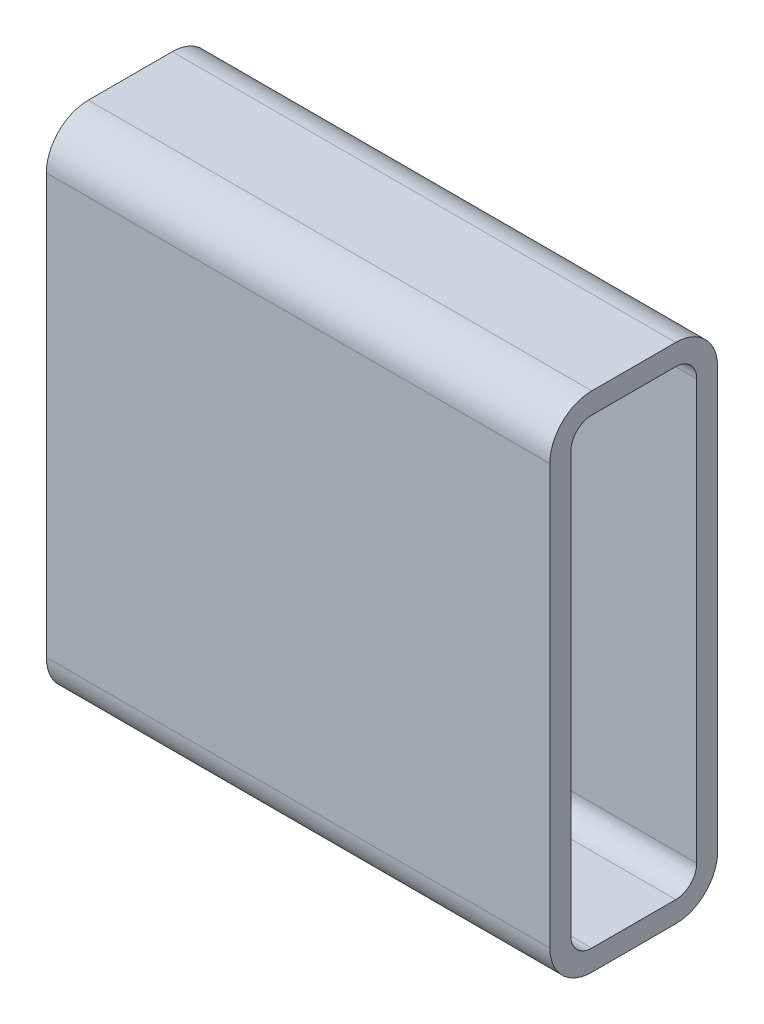
ISO-10303-21;
HEADER;
FILE_DESCRIPTION(('STEP AP214'),'2;1');
FILE_NAME('part.step','',(''),(''),'','','');
FILE_SCHEMA(('AUTOMOTIVE_DESIGN { 1 0 10303 214 1 1 1 1 }'));
ENDSEC;
DATA;
#1=APPLICATION_CONTEXT('core data for automotive mechanical design processes');
#2=APPLICATION_PROTOCOL_DEFINITION('international standard','automotive_design',2000,#1);
#3=PRODUCT_CONTEXT('',#1,'mechanical');
#4=PRODUCT('Part','Part','',(#3));
#5=PRODUCT_RELATED_PRODUCT_CATEGORY('part','',(#4));
#6=PRODUCT_DEFINITION_FORMATION('','',#4);
#7=PRODUCT_DEFINITION_CONTEXT('part definition',#1,'design');
#8=PRODUCT_DEFINITION('design','',#6,#7);
#9=PRODUCT_DEFINITION_SHAPE('','',#8);
#10=(LENGTH_UNIT() NAMED_UNIT(*) SI_UNIT(.MILLI.,.METRE.));
#11=(NAMED_UNIT(*) PLANE_ANGLE_UNIT() SI_UNIT($,.RADIAN.));
#12=(NAMED_UNIT(*) SI_UNIT($,.STERADIAN.) SOLID_ANGLE_UNIT());
#13=UNCERTAINTY_MEASURE_WITH_UNIT(LENGTH_MEASURE(1.E-05),#10,'distance_accuracy_value','');
#14=(GEOMETRIC_REPRESENTATION_CONTEXT(3) GLOBAL_UNCERTAINTY_ASSIGNED_CONTEXT((#13)) GLOBAL_UNIT_ASSIGNED_CONTEXT((#10,
#11,#12)) REPRESENTATION_CONTEXT('',''));
#15=CARTESIAN_POINT('',(0.,0.,0.));
#16=DIRECTION('',(0.,0.,1.));
#17=DIRECTION('',(1.,0.,0.));
#18=AXIS2_PLACEMENT_3D('',#15,#16,#17);
#19=CARTESIAN_POINT('',(0.,-38.1,-6.35));
#20=DIRECTION('',(0.,-1.,0.));
#21=DIRECTION('',(0.,0.,-1.));
#22=AXIS2_PLACEMENT_3D('',#19,#20,#21);
#23=PLANE('',#22);
#24=DIRECTION('',(1.,0.,0.));
#25=VECTOR('',#24,1.);
#26=CARTESIAN_POINT('',(0.,-38.1,-6.35));
#27=LINE('',#26,#25);
#28=CARTESIAN_POINT('',(0.,-38.1,-6.35));
#29=VERTEX_POINT('',#28);
#30=CARTESIAN_POINT('',(76.2,-38.1,-6.35));
#31=VERTEX_POINT('',#30);
#32=EDGE_CURVE('E111',#29,#31,#27,.T.);
#33=ORIENTED_EDGE('',*,*,#32,.F.);
#34=DIRECTION('',(0.,0.,-1.));
#35=VECTOR('',#34,1.);
#36=CARTESIAN_POINT('',(0.,-38.1,0.));
#37=LINE('',#36,#35);
#38=CARTESIAN_POINT('',(0.,-38.1,-19.05));
#39=VERTEX_POINT('',#38);
#40=EDGE_CURVE('E213',#29,#39,#37,.T.);
#41=ORIENTED_EDGE('',*,*,#40,.T.);
#42=DIRECTION('',(1.,0.,0.));
#43=VECTOR('',#42,1.);
#44=CARTESIAN_POINT('',(0.,-38.1,-19.05));
#45=LINE('',#44,#43);
#46=CARTESIAN_POINT('',(76.2,-38.1,-19.05));
#47=VERTEX_POINT('',#46);
#48=EDGE_CURVE('E188',#47,#39,#45,.F.);
#49=ORIENTED_EDGE('',*,*,#48,.F.);
#50=DIRECTION('',(0.,0.,-1.));
#51=VECTOR('',#50,1.);
#52=CARTESIAN_POINT('',(76.2,-38.1,0.));
#53=LINE('',#52,#51);
#54=EDGE_CURVE('E115',#31,#47,#53,.T.);
#55=ORIENTED_EDGE('',*,*,#54,.F.);
#56=EDGE_LOOP('',(#33,#41,#49,#55));
#57=FACE_BOUND('',#56,.T.);
#58=ADVANCED_FACE('F17',(#57),#23,.T.);
#59=CARTESIAN_POINT('',(0.,-31.75,-19.05));
#60=DIRECTION('',(1.,0.,0.));
#61=DIRECTION('',(0.,0.,-1.));
#62=AXIS2_PLACEMENT_3D('',#59,#60,#61);
#63=CYLINDRICAL_SURFACE('',#62,6.35);
#64=ORIENTED_EDGE('',*,*,#48,.T.);
#65=CARTESIAN_POINT('',(0.,-31.75,-19.05));
#66=DIRECTION('',(1.,0.,0.));
#67=DIRECTION('',(0.,0.,-1.));
#68=AXIS2_PLACEMENT_3D('',#65,#66,#67);
#69=CIRCLE('',#68,6.35);
#70=CARTESIAN_POINT('',(0.,-31.75,-25.4));
#71=VERTEX_POINT('',#70);
#72=EDGE_CURVE('E211',#39,#71,#69,.T.);
#73=ORIENTED_EDGE('',*,*,#72,.T.);
#74=DIRECTION('',(-1.,0.,0.));
#75=VECTOR('',#74,1.);
#76=CARTESIAN_POINT('',(0.,-31.75,-25.4));
#77=LINE('',#76,#75);
#78=CARTESIAN_POINT('',(76.2,-31.75,-25.4));
#79=VERTEX_POINT('',#78);
#80=EDGE_CURVE('E185',#79,#71,#77,.T.);
#81=ORIENTED_EDGE('',*,*,#80,.F.);
#82=CARTESIAN_POINT('',(76.2,-31.75,-19.05));
#83=DIRECTION('',(1.,0.,0.));
#84=DIRECTION('',(0.,0.,-1.));
#85=AXIS2_PLACEMENT_3D('',#82,#83,#84);
#86=CIRCLE('',#85,6.35);
#87=EDGE_CURVE('E154',#47,#79,#86,.T.);
#88=ORIENTED_EDGE('',*,*,#87,.F.);
#89=EDGE_LOOP('',(#64,#73,#81,#88));
#90=FACE_BOUND('',#89,.T.);
#91=ADVANCED_FACE('F229',(#90),#63,.T.);
#92=CARTESIAN_POINT('',(0.,-31.75,-25.4));
#93=DIRECTION('',(0.,0.,-1.));
#94=DIRECTION('',(-1.,0.,0.));
#95=AXIS2_PLACEMENT_3D('',#92,#93,#94);
#96=PLANE('',#95);
#97=ORIENTED_EDGE('',*,*,#80,.T.);
#98=DIRECTION('',(0.,1.,0.));
#99=VECTOR('',#98,1.);
#100=CARTESIAN_POINT('',(0.,0.,-25.4));
#101=LINE('',#100,#99);
#102=CARTESIAN_POINT('',(0.,31.75,-25.4));
#103=VERTEX_POINT('',#102);
#104=EDGE_CURVE('E210',#71,#103,#101,.T.);
#105=ORIENTED_EDGE('',*,*,#104,.T.);
#106=DIRECTION('',(1.,0.,0.));
#107=VECTOR('',#106,1.);
#108=CARTESIAN_POINT('',(0.,31.75,-25.4));
#109=LINE('',#108,#107);
#110=CARTESIAN_POINT('',(76.2,31.75,-25.4));
#111=VERTEX_POINT('',#110);
#112=EDGE_CURVE('E182',#111,#103,#109,.F.);
#113=ORIENTED_EDGE('',*,*,#112,.F.);
#114=DIRECTION('',(0.,1.,0.));
#115=VECTOR('',#114,1.);
#116=CARTESIAN_POINT('',(76.2,0.,-25.4));
#117=LINE('',#116,#115);
#118=EDGE_CURVE('E151',#79,#111,#117,.T.);
#119=ORIENTED_EDGE('',*,*,#118,.F.);
#120=EDGE_LOOP('',(#97,#105,#113,#119));
#121=FACE_BOUND('',#120,.T.);
#122=ADVANCED_FACE('F233',(#121),#96,.T.);
#123=CARTESIAN_POINT('',(0.,31.75,-19.05));
#124=DIRECTION('',(1.,0.,0.));
#125=DIRECTION('',(0.,0.,-1.));
#126=AXIS2_PLACEMENT_3D('',#123,#124,#125);
#127=CYLINDRICAL_SURFACE('',#126,6.35);
#128=ORIENTED_EDGE('',*,*,#112,.T.);
#129=CARTESIAN_POINT('',(0.,31.75,-19.05));
#130=DIRECTION('',(1.,0.,0.));
#131=DIRECTION('',(0.,0.,-1.));
#132=AXIS2_PLACEMENT_3D('',#129,#130,#131);
#133=CIRCLE('',#132,6.35);
#134=CARTESIAN_POINT('',(0.,38.1,-19.05));
#135=VERTEX_POINT('',#134);
#136=EDGE_CURVE('E208',#103,#135,#133,.T.);
#137=ORIENTED_EDGE('',*,*,#136,.T.);
#138=DIRECTION('',(1.,0.,0.));
#139=VECTOR('',#138,1.);
#140=CARTESIAN_POINT('',(0.,38.1,-19.05));
#141=LINE('',#140,#139);
#142=CARTESIAN_POINT('',(76.2,38.1,-19.05));
#143=VERTEX_POINT('',#142);
#144=EDGE_CURVE('E176',#143,#135,#141,.F.);
#145=ORIENTED_EDGE('',*,*,#144,.F.);
#146=CARTESIAN_POINT('',(76.2,31.75,-19.05));
#147=DIRECTION('',(1.,0.,0.));
#148=DIRECTION('',(0.,0.,-1.));
#149=AXIS2_PLACEMENT_3D('',#146,#147,#148);
#150=CIRCLE('',#149,6.35);
#151=EDGE_CURVE('E150',#111,#143,#150,.T.);
#152=ORIENTED_EDGE('',*,*,#151,.F.);
#153=EDGE_LOOP('',(#128,#137,#145,#152));
#154=FACE_BOUND('',#153,.T.);
#155=ADVANCED_FACE('F237',(#154),#127,.T.);
#156=CARTESIAN_POINT('',(0.,38.1,-19.05));
#157=DIRECTION('',(0.,1.,0.));
#158=DIRECTION('',(0.,0.,1.));
#159=AXIS2_PLACEMENT_3D('',#156,#157,#158);
#160=PLANE('',#159);
#161=ORIENTED_EDGE('',*,*,#144,.T.);
#162=DIRECTION('',(0.,0.,-1.));
#163=VECTOR('',#162,1.);
#164=CARTESIAN_POINT('',(0.,38.1,0.));
#165=LINE('',#164,#163);
#166=CARTESIAN_POINT('',(0.,38.1,-6.35));
#167=VERTEX_POINT('',#166);
#168=EDGE_CURVE('E207',#135,#167,#165,.F.);
#169=ORIENTED_EDGE('',*,*,#168,.T.);
#170=DIRECTION('',(1.,0.,0.));
#171=VECTOR('',#170,1.);
#172=CARTESIAN_POINT('',(0.,38.1,-6.35));
#173=LINE('',#172,#171);
#174=CARTESIAN_POINT('',(76.2,38.1,-6.35));
#175=VERTEX_POINT('',#174);
#176=EDGE_CURVE('E177',#175,#167,#173,.F.);
#177=ORIENTED_EDGE('',*,*,#176,.F.);
#178=DIRECTION('',(0.,0.,-1.));
#179=VECTOR('',#178,1.);
#180=CARTESIAN_POINT('',(76.2,38.1,0.));
#181=LINE('',#180,#179);
#182=EDGE_CURVE('E148',#143,#175,#181,.F.);
#183=ORIENTED_EDGE('',*,*,#182,.F.);
#184=EDGE_LOOP('',(#161,#169,#177,#183));
#185=FACE_BOUND('',#184,.T.);
#186=ADVANCED_FACE('F242',(#185),#160,.T.);
#187=CARTESIAN_POINT('',(0.,-31.75,-19.05));
#188=DIRECTION('',(1.,0.,0.));
#189=DIRECTION('',(0.,0.,-1.));
#190=AXIS2_PLACEMENT_3D('',#187,#188,#189);
#191=CYLINDRICAL_SURFACE('',#190,3.175);
#192=CARTESIAN_POINT('',(76.2,-31.75,-19.05));
#193=DIRECTION('',(1.,0.,0.));
#194=DIRECTION('',(0.,0.,-1.));
#195=AXIS2_PLACEMENT_3D('',#192,#193,#194);
#196=CIRCLE('',#195,3.175);
#197=CARTESIAN_POINT('',(76.2,-31.75,-22.225));
#198=VERTEX_POINT('',#197);
#199=CARTESIAN_POINT('',(76.2,-34.925,-19.05));
#200=VERTEX_POINT('',#199);
#201=EDGE_CURVE('E135',#198,#200,#196,.F.);
#202=ORIENTED_EDGE('',*,*,#201,.F.);
#203=DIRECTION('',(1.,0.,0.));
#204=VECTOR('',#203,1.);
#205=CARTESIAN_POINT('',(0.,-31.75,-22.225));
#206=LINE('',#205,#204);
#207=CARTESIAN_POINT('',(0.,-31.75,-22.225));
#208=VERTEX_POINT('',#207);
#209=EDGE_CURVE('E159',#208,#198,#206,.T.);
#210=ORIENTED_EDGE('',*,*,#209,.F.);
#211=CARTESIAN_POINT('',(0.,-31.75,-19.05));
#212=DIRECTION('',(1.,0.,0.));
#213=DIRECTION('',(0.,0.,-1.));
#214=AXIS2_PLACEMENT_3D('',#211,#212,#213);
#215=CIRCLE('',#214,3.175);
#216=CARTESIAN_POINT('',(0.,-34.925,-19.05));
#217=VERTEX_POINT('',#216);
#218=EDGE_CURVE('E203',#208,#217,#215,.F.);
#219=ORIENTED_EDGE('',*,*,#218,.T.);
#220=DIRECTION('',(1.,0.,0.));
#221=VECTOR('',#220,1.);
#222=CARTESIAN_POINT('',(0.,-34.925,-19.05));
#223=LINE('',#222,#221);
#224=EDGE_CURVE('E173',#200,#217,#223,.F.);
#225=ORIENTED_EDGE('',*,*,#224,.F.);
#226=EDGE_LOOP('',(#202,#210,#219,#225));
#227=FACE_BOUND('',#226,.T.);
#228=ADVANCED_FACE('F307',(#227),#191,.F.);
#229=CARTESIAN_POINT('',(0.,-34.925,-19.05));
#230=DIRECTION('',(0.,1.,0.));
#231=DIRECTION('',(0.,0.,1.));
#232=AXIS2_PLACEMENT_3D('',#229,#230,#231);
#233=PLANE('',#232);
#234=ORIENTED_EDGE('',*,*,#224,.T.);
#235=DIRECTION('',(0.,0.,-1.));
#236=VECTOR('',#235,1.);
#237=CARTESIAN_POINT('',(0.,-34.925,0.));
#238=LINE('',#237,#236);
#239=CARTESIAN_POINT('',(0.,-34.925,-6.35));
#240=VERTEX_POINT('',#239);
#241=EDGE_CURVE('E202',#217,#240,#238,.F.);
#242=ORIENTED_EDGE('',*,*,#241,.T.);
#243=DIRECTION('',(1.,0.,0.));
#244=VECTOR('',#243,1.);
#245=CARTESIAN_POINT('',(0.,-34.925,-6.35));
#246=LINE('',#245,#244);
#247=CARTESIAN_POINT('',(76.2,-34.925,-6.35));
#248=VERTEX_POINT('',#247);
#249=EDGE_CURVE('E171',#240,#248,#246,.T.);
#250=ORIENTED_EDGE('',*,*,#249,.T.);
#251=DIRECTION('',(0.,0.,-1.));
#252=VECTOR('',#251,1.);
#253=CARTESIAN_POINT('',(76.2,-34.925,0.));
#254=LINE('',#253,#252);
#255=EDGE_CURVE('E145',#200,#248,#254,.F.);
#256=ORIENTED_EDGE('',*,*,#255,.F.);
#257=EDGE_LOOP('',(#234,#242,#250,#256));
#258=FACE_BOUND('',#257,.T.);
#259=ADVANCED_FACE('F306',(#258),#233,.T.);
#260=CARTESIAN_POINT('',(0.,-31.75,-6.35));
#261=DIRECTION('',(1.,0.,0.));
#262=DIRECTION('',(0.,0.,-1.));
#263=AXIS2_PLACEMENT_3D('',#260,#261,#262);
#264=CYLINDRICAL_SURFACE('',#263,3.175);
#265=CARTESIAN_POINT('',(76.2,-31.75,-6.35));
#266=DIRECTION('',(1.,0.,0.));
#267=DIRECTION('',(0.,0.,-1.));
#268=AXIS2_PLACEMENT_3D('',#265,#266,#267);
#269=CIRCLE('',#268,3.175);
#270=CARTESIAN_POINT('',(76.2,-31.75,-3.175));
#271=VERTEX_POINT('',#270);
#272=EDGE_CURVE('E144',#248,#271,#269,.F.);
#273=ORIENTED_EDGE('',*,*,#272,.F.);
#274=ORIENTED_EDGE('',*,*,#249,.F.);
#275=CARTESIAN_POINT('',(0.,-31.75,-6.35));
#276=DIRECTION('',(1.,0.,0.));
#277=DIRECTION('',(0.,0.,-1.));
#278=AXIS2_PLACEMENT_3D('',#275,#276,#277);
#279=CIRCLE('',#278,3.175);
#280=CARTESIAN_POINT('',(0.,-31.75,-3.175));
#281=VERTEX_POINT('',#280);
#282=EDGE_CURVE('E199',#240,#281,#279,.F.);
#283=ORIENTED_EDGE('',*,*,#282,.T.);
#284=DIRECTION('',(-1.,0.,0.));
#285=VECTOR('',#284,1.);
#286=CARTESIAN_POINT('',(0.,-31.75,-3.175));
#287=LINE('',#286,#285);
#288=EDGE_CURVE('E168',#271,#281,#287,.T.);
#289=ORIENTED_EDGE('',*,*,#288,.F.);
#290=EDGE_LOOP('',(#273,#274,#283,#289));
#291=FACE_BOUND('',#290,.T.);
#292=ADVANCED_FACE('F304',(#291),#264,.F.);
#293=CARTESIAN_POINT('',(0.,-31.75,-3.175));
#294=DIRECTION('',(0.,0.,-1.));
#295=DIRECTION('',(-1.,0.,0.));
#296=AXIS2_PLACEMENT_3D('',#293,#294,#295);
#297=PLANE('',#296);
#298=ORIENTED_EDGE('',*,*,#288,.T.);
#299=DIRECTION('',(0.,1.,0.));
#300=VECTOR('',#299,1.);
#301=CARTESIAN_POINT('',(0.,0.,-3.175));
#302=LINE('',#301,#300);
#303=CARTESIAN_POINT('',(0.,31.75,-3.175));
#304=VERTEX_POINT('',#303);
#305=EDGE_CURVE('E198',#281,#304,#302,.T.);
#306=ORIENTED_EDGE('',*,*,#305,.T.);
#307=DIRECTION('',(1.,0.,0.));
#308=VECTOR('',#307,1.);
#309=CARTESIAN_POINT('',(0.,31.75,-3.175));
#310=LINE('',#309,#308);
#311=CARTESIAN_POINT('',(76.2,31.75,-3.175));
#312=VERTEX_POINT('',#311);
#313=EDGE_CURVE('E166',#304,#312,#310,.T.);
#314=ORIENTED_EDGE('',*,*,#313,.T.);
#315=DIRECTION('',(0.,1.,0.));
#316=VECTOR('',#315,1.);
#317=CARTESIAN_POINT('',(76.2,0.,-3.175));
#318=LINE('',#317,#316);
#319=EDGE_CURVE('E141',#271,#312,#318,.T.);
#320=ORIENTED_EDGE('',*,*,#319,.F.);
#321=EDGE_LOOP('',(#298,#306,#314,#320));
#322=FACE_BOUND('',#321,.T.);
#323=ADVANCED_FACE('F293',(#322),#297,.T.);
#324=CARTESIAN_POINT('',(0.,31.75,-6.35));
#325=DIRECTION('',(1.,0.,0.));
#326=DIRECTION('',(0.,0.,-1.));
#327=AXIS2_PLACEMENT_3D('',#324,#325,#326);
#328=CYLINDRICAL_SURFACE('',#327,3.175);
#329=CARTESIAN_POINT('',(76.2,31.75,-6.35));
#330=DIRECTION('',(1.,0.,0.));
#331=DIRECTION('',(0.,0.,-1.));
#332=AXIS2_PLACEMENT_3D('',#329,#330,#331);
#333=CIRCLE('',#332,3.175);
#334=CARTESIAN_POINT('',(76.2,34.925,-6.35));
#335=VERTEX_POINT('',#334);
#336=EDGE_CURVE('E140',#312,#335,#333,.F.);
#337=ORIENTED_EDGE('',*,*,#336,.F.);
#338=ORIENTED_EDGE('',*,*,#313,.F.);
#339=CARTESIAN_POINT('',(0.,31.75,-6.35));
#340=DIRECTION('',(1.,0.,0.));
#341=DIRECTION('',(0.,0.,-1.));
#342=AXIS2_PLACEMENT_3D('',#339,#340,#341);
#343=CIRCLE('',#342,3.175);
#344=CARTESIAN_POINT('',(0.,34.925,-6.35));
#345=VERTEX_POINT('',#344);
#346=EDGE_CURVE('E195',#304,#345,#343,.F.);
#347=ORIENTED_EDGE('',*,*,#346,.T.);
#348=DIRECTION('',(1.,0.,0.));
#349=VECTOR('',#348,1.);
#350=CARTESIAN_POINT('',(0.,34.925,-6.35));
#351=LINE('',#350,#349);
#352=EDGE_CURVE('E163',#335,#345,#351,.F.);
#353=ORIENTED_EDGE('',*,*,#352,.F.);
#354=EDGE_LOOP('',(#337,#338,#347,#353));
#355=FACE_BOUND('',#354,.T.);
#356=ADVANCED_FACE('F298',(#355),#328,.F.);
#357=CARTESIAN_POINT('',(0.,34.925,-6.35));
#358=DIRECTION('',(0.,-1.,0.));
#359=DIRECTION('',(0.,0.,-1.));
#360=AXIS2_PLACEMENT_3D('',#357,#358,#359);
#361=PLANE('',#360);
#362=ORIENTED_EDGE('',*,*,#352,.T.);
#363=DIRECTION('',(0.,0.,-1.));
#364=VECTOR('',#363,1.);
#365=CARTESIAN_POINT('',(0.,34.925,0.));
#366=LINE('',#365,#364);
#367=CARTESIAN_POINT('',(0.,34.925,-19.05));
#368=VERTEX_POINT('',#367);
#369=EDGE_CURVE('E194',#345,#368,#366,.T.);
#370=ORIENTED_EDGE('',*,*,#369,.T.);
#371=DIRECTION('',(1.,0.,0.));
#372=VECTOR('',#371,1.);
#373=CARTESIAN_POINT('',(0.,34.925,-19.05));
#374=LINE('',#373,#372);
#375=CARTESIAN_POINT('',(76.2,34.925,-19.05));
#376=VERTEX_POINT('',#375);
#377=EDGE_CURVE('E161',#368,#376,#374,.T.);
#378=ORIENTED_EDGE('',*,*,#377,.T.);
#379=DIRECTION('',(0.,0.,-1.));
#380=VECTOR('',#379,1.);
#381=CARTESIAN_POINT('',(76.2,34.925,0.));
#382=LINE('',#381,#380);
#383=EDGE_CURVE('E137',#335,#376,#382,.T.);
#384=ORIENTED_EDGE('',*,*,#383,.F.);
#385=EDGE_LOOP('',(#362,#370,#378,#384));
#386=FACE_BOUND('',#385,.T.);
#387=ADVANCED_FACE('F258',(#386),#361,.T.);
#388=CARTESIAN_POINT('',(0.,31.75,-19.05));
#389=DIRECTION('',(1.,0.,0.));
#390=DIRECTION('',(0.,0.,-1.));
#391=AXIS2_PLACEMENT_3D('',#388,#389,#390);
#392=CYLINDRICAL_SURFACE('',#391,3.175);
#393=CARTESIAN_POINT('',(76.2,31.75,-19.05));
#394=DIRECTION('',(1.,0.,0.));
#395=DIRECTION('',(0.,0.,-1.));
#396=AXIS2_PLACEMENT_3D('',#393,#394,#395);
#397=CIRCLE('',#396,3.175);
#398=CARTESIAN_POINT('',(76.2,31.75,-22.225));
#399=VERTEX_POINT('',#398);
#400=EDGE_CURVE('E136',#376,#399,#397,.F.);
#401=ORIENTED_EDGE('',*,*,#400,.F.);
#402=ORIENTED_EDGE('',*,*,#377,.F.);
#403=CARTESIAN_POINT('',(0.,31.75,-19.05));
#404=DIRECTION('',(1.,0.,0.));
#405=DIRECTION('',(0.,0.,-1.));
#406=AXIS2_PLACEMENT_3D('',#403,#404,#405);
#407=CIRCLE('',#406,3.175);
#408=CARTESIAN_POINT('',(0.,31.75,-22.225));
#409=VERTEX_POINT('',#408);
#410=EDGE_CURVE('E128',#368,#409,#407,.F.);
#411=ORIENTED_EDGE('',*,*,#410,.T.);
#412=DIRECTION('',(1.,0.,0.));
#413=VECTOR('',#412,1.);
#414=CARTESIAN_POINT('',(0.,31.75,-22.225));
#415=LINE('',#414,#413);
#416=EDGE_CURVE('E156',#399,#409,#415,.F.);
#417=ORIENTED_EDGE('',*,*,#416,.F.);
#418=EDGE_LOOP('',(#401,#402,#411,#417));
#419=FACE_BOUND('',#418,.T.);
#420=ADVANCED_FACE('F267',(#419),#392,.F.);
#421=CARTESIAN_POINT('',(0.,31.75,-22.225));
#422=DIRECTION('',(0.,0.,1.));
#423=DIRECTION('',(1.,0.,0.));
#424=AXIS2_PLACEMENT_3D('',#421,#422,#423);
#425=PLANE('',#424);
#426=ORIENTED_EDGE('',*,*,#416,.T.);
#427=DIRECTION('',(0.,1.,0.));
#428=VECTOR('',#427,1.);
#429=CARTESIAN_POINT('',(0.,0.,-22.225));
#430=LINE('',#429,#428);
#431=EDGE_CURVE('E125',#409,#208,#430,.F.);
#432=ORIENTED_EDGE('',*,*,#431,.T.);
#433=ORIENTED_EDGE('',*,*,#209,.T.);
#434=DIRECTION('',(0.,1.,0.));
#435=VECTOR('',#434,1.);
#436=CARTESIAN_POINT('',(76.2,0.,-22.225));
#437=LINE('',#436,#435);
#438=EDGE_CURVE('E132',#399,#198,#437,.F.);
#439=ORIENTED_EDGE('',*,*,#438,.F.);
#440=EDGE_LOOP('',(#426,#432,#433,#439));
#441=FACE_BOUND('',#440,.T.);
#442=ADVANCED_FACE('F276',(#441),#425,.T.);
#443=CARTESIAN_POINT('',(0.,-31.75,-6.35));
#444=DIRECTION('',(1.,0.,0.));
#445=DIRECTION('',(0.,0.,-1.));
#446=AXIS2_PLACEMENT_3D('',#443,#444,#445);
#447=CYLINDRICAL_SURFACE('',#446,6.35);
#448=DIRECTION('',(1.,0.,0.));
#449=VECTOR('',#448,1.);
#450=CARTESIAN_POINT('',(0.,-31.75,0.));
#451=LINE('',#450,#449);
#452=CARTESIAN_POINT('',(0.,-31.75,0.));
#453=VERTEX_POINT('',#452);
#454=CARTESIAN_POINT('',(76.2,-31.75,0.));
#455=VERTEX_POINT('',#454);
#456=EDGE_CURVE('E109',#453,#455,#451,.T.);
#457=ORIENTED_EDGE('',*,*,#456,.F.);
#458=CARTESIAN_POINT('',(0.,-31.75,-6.35));
#459=DIRECTION('',(1.,0.,0.));
#460=DIRECTION('',(0.,0.,-1.));
#461=AXIS2_PLACEMENT_3D('',#458,#459,#460);
#462=CIRCLE('',#461,6.35);
#463=EDGE_CURVE('E179',#453,#29,#462,.T.);
#464=ORIENTED_EDGE('',*,*,#463,.T.);
#465=ORIENTED_EDGE('',*,*,#32,.T.);
#466=CARTESIAN_POINT('',(76.2,-31.75,-6.35));
#467=DIRECTION('',(1.,0.,0.));
#468=DIRECTION('',(0.,0.,-1.));
#469=AXIS2_PLACEMENT_3D('',#466,#467,#468);
#470=CIRCLE('',#469,6.35);
#471=EDGE_CURVE('E20',#455,#31,#470,.T.);
#472=ORIENTED_EDGE('',*,*,#471,.F.);
#473=EDGE_LOOP('',(#457,#464,#465,#472));
#474=FACE_BOUND('',#473,.T.);
#475=ADVANCED_FACE('F106',(#474),#447,.T.);
#476=CARTESIAN_POINT('',(76.2,0.,0.));
#477=DIRECTION('',(1.,0.,0.));
#478=DIRECTION('',(0.,0.,-1.));
#479=AXIS2_PLACEMENT_3D('',#476,#477,#478);
#480=PLANE('',#479);
#481=ORIENTED_EDGE('',*,*,#438,.T.);
#482=ORIENTED_EDGE('',*,*,#201,.T.);
#483=ORIENTED_EDGE('',*,*,#255,.T.);
#484=ORIENTED_EDGE('',*,*,#272,.T.);
#485=ORIENTED_EDGE('',*,*,#319,.T.);
#486=ORIENTED_EDGE('',*,*,#336,.T.);
#487=ORIENTED_EDGE('',*,*,#383,.T.);
#488=ORIENTED_EDGE('',*,*,#400,.T.);
#489=EDGE_LOOP('',(#481,#482,#483,#484,#485,#486,#487,#488));
#490=FACE_BOUND('',#489,.T.);
#491=CARTESIAN_POINT('',(76.2,31.75,-6.35));
#492=DIRECTION('',(1.,0.,0.));
#493=DIRECTION('',(0.,0.,-1.));
#494=AXIS2_PLACEMENT_3D('',#491,#492,#493);
#495=CIRCLE('',#494,6.35);
#496=CARTESIAN_POINT('',(76.2,31.75,0.));
#497=VERTEX_POINT('',#496);
#498=EDGE_CURVE('E120',#497,#175,#495,.F.);
#499=ORIENTED_EDGE('',*,*,#498,.F.);
#500=DIRECTION('',(0.,1.,0.));
#501=VECTOR('',#500,1.);
#502=CARTESIAN_POINT('',(76.2,31.75,0.));
#503=LINE('',#502,#501);
#504=EDGE_CURVE('E117',#455,#497,#503,.T.);
#505=ORIENTED_EDGE('',*,*,#504,.F.);
#506=ORIENTED_EDGE('',*,*,#471,.T.);
#507=ORIENTED_EDGE('',*,*,#54,.T.);
#508=ORIENTED_EDGE('',*,*,#87,.T.);
#509=ORIENTED_EDGE('',*,*,#118,.T.);
#510=ORIENTED_EDGE('',*,*,#151,.T.);
#511=ORIENTED_EDGE('',*,*,#182,.T.);
#512=EDGE_LOOP('',(#499,#505,#506,#507,#508,#509,#510,#511));
#513=FACE_BOUND('',#512,.T.);
#514=ADVANCED_FACE('F118',(#490,#513),#480,.T.);
#515=CARTESIAN_POINT('',(0.,31.75,-6.35));
#516=DIRECTION('',(1.,0.,0.));
#517=DIRECTION('',(0.,0.,-1.));
#518=AXIS2_PLACEMENT_3D('',#515,#516,#517);
#519=CYLINDRICAL_SURFACE('',#518,6.35);
#520=ORIENTED_EDGE('',*,*,#176,.T.);
#521=CARTESIAN_POINT('',(0.,31.75,-6.35));
#522=DIRECTION('',(1.,0.,0.));
#523=DIRECTION('',(0.,0.,-1.));
#524=AXIS2_PLACEMENT_3D('',#521,#522,#523);
#525=CIRCLE('',#524,6.35);
#526=CARTESIAN_POINT('',(0.,31.75,0.));
#527=VERTEX_POINT('',#526);
#528=EDGE_CURVE('E35',#167,#527,#525,.T.);
#529=ORIENTED_EDGE('',*,*,#528,.T.);
#530=DIRECTION('',(1.,0.,0.));
#531=VECTOR('',#530,1.);
#532=CARTESIAN_POINT('',(0.,31.75,0.));
#533=LINE('',#532,#531);
#534=EDGE_CURVE('E26',#497,#527,#533,.F.);
#535=ORIENTED_EDGE('',*,*,#534,.F.);
#536=ORIENTED_EDGE('',*,*,#498,.T.);
#537=EDGE_LOOP('',(#520,#529,#535,#536));
#538=FACE_BOUND('',#537,.T.);
#539=ADVANCED_FACE('F244',(#538),#519,.T.);
#540=CARTESIAN_POINT('',(0.,0.,0.));
#541=DIRECTION('',(1.,0.,0.));
#542=DIRECTION('',(0.,0.,-1.));
#543=AXIS2_PLACEMENT_3D('',#540,#541,#542);
#544=PLANE('',#543);
#545=ORIENTED_EDGE('',*,*,#410,.F.);
#546=ORIENTED_EDGE('',*,*,#369,.F.);
#547=ORIENTED_EDGE('',*,*,#346,.F.);
#548=ORIENTED_EDGE('',*,*,#305,.F.);
#549=ORIENTED_EDGE('',*,*,#282,.F.);
#550=ORIENTED_EDGE('',*,*,#241,.F.);
#551=ORIENTED_EDGE('',*,*,#218,.F.);
#552=ORIENTED_EDGE('',*,*,#431,.F.);
#553=EDGE_LOOP('',(#545,#546,#547,#548,#549,#550,#551,#552));
#554=FACE_BOUND('',#553,.T.);
#555=ORIENTED_EDGE('',*,*,#168,.F.);
#556=ORIENTED_EDGE('',*,*,#136,.F.);
#557=ORIENTED_EDGE('',*,*,#104,.F.);
#558=ORIENTED_EDGE('',*,*,#72,.F.);
#559=ORIENTED_EDGE('',*,*,#40,.F.);
#560=ORIENTED_EDGE('',*,*,#463,.F.);
#561=DIRECTION('',(0.,1.,0.));
#562=VECTOR('',#561,1.);
#563=CARTESIAN_POINT('',(0.,31.75,0.));
#564=LINE('',#563,#562);
#565=EDGE_CURVE('E11',#527,#453,#564,.F.);
#566=ORIENTED_EDGE('',*,*,#565,.F.);
#567=ORIENTED_EDGE('',*,*,#528,.F.);
#568=EDGE_LOOP('',(#555,#556,#557,#558,#559,#560,#566,#567));
#569=FACE_BOUND('',#568,.T.);
#570=ADVANCED_FACE('F269',(#554,#569),#544,.F.);
#571=CARTESIAN_POINT('',(0.,31.75,0.));
#572=DIRECTION('',(0.,0.,1.));
#573=DIRECTION('',(1.,0.,0.));
#574=AXIS2_PLACEMENT_3D('',#571,#572,#573);
#575=PLANE('',#574);
#576=ORIENTED_EDGE('',*,*,#534,.T.);
#577=ORIENTED_EDGE('',*,*,#565,.T.);
#578=ORIENTED_EDGE('',*,*,#456,.T.);
#579=ORIENTED_EDGE('',*,*,#504,.T.);
#580=EDGE_LOOP('',(#576,#577,#578,#579));
#581=FACE_BOUND('',#580,.T.);
#582=ADVANCED_FACE('F124',(#581),#575,.T.);
#583=CLOSED_SHELL('',(#58,#91,#122,#155,#186,#228,#259,#292,#323,#356,#387,#420,#442,#475,#514,
#539,#570,#582));
#584=MANIFOLD_SOLID_BREP('B1',#583);
#585=ADVANCED_BREP_SHAPE_REPRESENTATION('',(#18,#584),#14);
#586=SHAPE_DEFINITION_REPRESENTATION(#9,#585);
ENDSEC;
END-ISO-10303-21;
